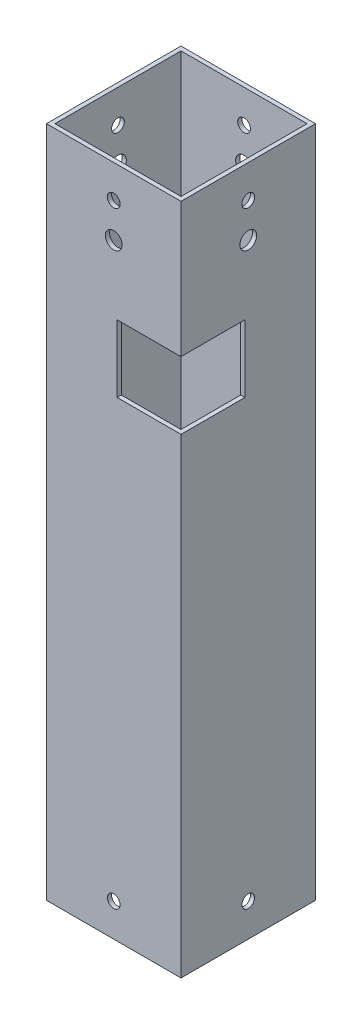
ISO-10303-21;
HEADER;
FILE_DESCRIPTION(('STEP AP214'),'2;1');
FILE_NAME('part.step','',(''),(''),'','','');
FILE_SCHEMA(('AUTOMOTIVE_DESIGN { 1 0 10303 214 1 1 1 1 }'));
ENDSEC;
DATA;
#1=APPLICATION_CONTEXT('core data for automotive mechanical design processes');
#2=APPLICATION_PROTOCOL_DEFINITION('international standard','automotive_design',2000,#1);
#3=PRODUCT_CONTEXT('',#1,'mechanical');
#4=PRODUCT('Part','Part','',(#3));
#5=PRODUCT_RELATED_PRODUCT_CATEGORY('part','',(#4));
#6=PRODUCT_DEFINITION_FORMATION('','',#4);
#7=PRODUCT_DEFINITION_CONTEXT('part definition',#1,'design');
#8=PRODUCT_DEFINITION('design','',#6,#7);
#9=PRODUCT_DEFINITION_SHAPE('','',#8);
#10=(LENGTH_UNIT() NAMED_UNIT(*) SI_UNIT(.MILLI.,.METRE.));
#11=(NAMED_UNIT(*) PLANE_ANGLE_UNIT() SI_UNIT($,.RADIAN.));
#12=(NAMED_UNIT(*) SI_UNIT($,.STERADIAN.) SOLID_ANGLE_UNIT());
#13=UNCERTAINTY_MEASURE_WITH_UNIT(LENGTH_MEASURE(1.E-05),#10,'distance_accuracy_value','');
#14=(GEOMETRIC_REPRESENTATION_CONTEXT(3) GLOBAL_UNCERTAINTY_ASSIGNED_CONTEXT((#13)) GLOBAL_UNIT_ASSIGNED_CONTEXT((#10,
#11,#12)) REPRESENTATION_CONTEXT('',''));
#15=CARTESIAN_POINT('',(0.,0.,0.));
#16=DIRECTION('',(0.,0.,1.));
#17=DIRECTION('',(1.,0.,0.));
#18=AXIS2_PLACEMENT_3D('',#15,#16,#17);
#19=CARTESIAN_POINT('',(0.,254.,0.));
#20=DIRECTION('',(0.,1.,0.));
#21=DIRECTION('',(0.,0.,1.));
#22=AXIS2_PLACEMENT_3D('',#19,#20,#21);
#23=PLANE('',#22);
#24=DIRECTION('',(0.,0.,1.));
#25=VECTOR('',#24,1.);
#26=CARTESIAN_POINT('',(-25.4,254.,-25.4));
#27=LINE('',#26,#25);
#28=CARTESIAN_POINT('',(-25.4,254.,-25.4));
#29=VERTEX_POINT('',#28);
#30=CARTESIAN_POINT('',(-25.4,254.,25.4));
#31=VERTEX_POINT('',#30);
#32=EDGE_CURVE('E304',#29,#31,#27,.T.);
#33=ORIENTED_EDGE('',*,*,#32,.T.);
#34=DIRECTION('',(1.,0.,0.));
#35=VECTOR('',#34,1.);
#36=CARTESIAN_POINT('',(-25.4,254.,25.4));
#37=LINE('',#36,#35);
#38=CARTESIAN_POINT('',(25.4,254.,25.4));
#39=VERTEX_POINT('',#38);
#40=EDGE_CURVE('E308',#31,#39,#37,.T.);
#41=ORIENTED_EDGE('',*,*,#40,.T.);
#42=DIRECTION('',(0.,0.,-1.));
#43=VECTOR('',#42,1.);
#44=CARTESIAN_POINT('',(25.4,254.,-25.4));
#45=LINE('',#44,#43);
#46=CARTESIAN_POINT('',(25.4,254.,-25.4));
#47=VERTEX_POINT('',#46);
#48=EDGE_CURVE('E312',#39,#47,#45,.T.);
#49=ORIENTED_EDGE('',*,*,#48,.T.);
#50=DIRECTION('',(-1.,0.,0.));
#51=VECTOR('',#50,1.);
#52=CARTESIAN_POINT('',(-25.4,254.,-25.4));
#53=LINE('',#52,#51);
#54=EDGE_CURVE('E315',#47,#29,#53,.T.);
#55=ORIENTED_EDGE('',*,*,#54,.T.);
#56=EDGE_LOOP('',(#33,#41,#49,#55));
#57=FACE_BOUND('',#56,.T.);
#58=DIRECTION('',(1.,0.,0.));
#59=VECTOR('',#58,1.);
#60=CARTESIAN_POINT('',(-23.8125,254.,23.8125));
#61=LINE('',#60,#59);
#62=CARTESIAN_POINT('',(-23.8125,254.,23.8125));
#63=VERTEX_POINT('',#62);
#64=CARTESIAN_POINT('',(23.8125,254.,23.8125));
#65=VERTEX_POINT('',#64);
#66=EDGE_CURVE('E262',#63,#65,#61,.T.);
#67=ORIENTED_EDGE('',*,*,#66,.F.);
#68=DIRECTION('',(0.,0.,1.));
#69=VECTOR('',#68,1.);
#70=CARTESIAN_POINT('',(-23.8125,254.,-23.8125));
#71=LINE('',#70,#69);
#72=CARTESIAN_POINT('',(-23.8125,254.,-23.8125));
#73=VERTEX_POINT('',#72);
#74=EDGE_CURVE('E259',#73,#63,#71,.T.);
#75=ORIENTED_EDGE('',*,*,#74,.F.);
#76=DIRECTION('',(-1.,0.,0.));
#77=VECTOR('',#76,1.);
#78=CARTESIAN_POINT('',(-23.8125,254.,-23.8125));
#79=LINE('',#78,#77);
#80=CARTESIAN_POINT('',(23.8125,254.,-23.8125));
#81=VERTEX_POINT('',#80);
#82=EDGE_CURVE('E270',#81,#73,#79,.T.);
#83=ORIENTED_EDGE('',*,*,#82,.F.);
#84=DIRECTION('',(0.,0.,-1.));
#85=VECTOR('',#84,1.);
#86=CARTESIAN_POINT('',(23.8125,254.,-23.8125));
#87=LINE('',#86,#85);
#88=EDGE_CURVE('E266',#65,#81,#87,.T.);
#89=ORIENTED_EDGE('',*,*,#88,.F.);
#90=EDGE_LOOP('',(#67,#75,#83,#89));
#91=FACE_BOUND('',#90,.T.);
#92=ADVANCED_FACE('F43',(#57,#91),#23,.T.);
#93=CARTESIAN_POINT('',(0.,0.,0.));
#94=DIRECTION('',(0.,1.,0.));
#95=DIRECTION('',(0.,0.,1.));
#96=AXIS2_PLACEMENT_3D('',#93,#94,#95);
#97=PLANE('',#96);
#98=DIRECTION('',(0.,0.,1.));
#99=VECTOR('',#98,1.);
#100=CARTESIAN_POINT('',(-25.4,0.,-25.4));
#101=LINE('',#100,#99);
#102=CARTESIAN_POINT('',(-25.4,0.,-25.4));
#103=VERTEX_POINT('',#102);
#104=CARTESIAN_POINT('',(-25.4,0.,25.4));
#105=VERTEX_POINT('',#104);
#106=EDGE_CURVE('E303',#103,#105,#101,.T.);
#107=ORIENTED_EDGE('',*,*,#106,.F.);
#108=DIRECTION('',(-1.,0.,0.));
#109=VECTOR('',#108,1.);
#110=CARTESIAN_POINT('',(-25.4,0.,-25.4));
#111=LINE('',#110,#109);
#112=CARTESIAN_POINT('',(25.4,0.,-25.4));
#113=VERTEX_POINT('',#112);
#114=EDGE_CURVE('E309',#113,#103,#111,.T.);
#115=ORIENTED_EDGE('',*,*,#114,.F.);
#116=DIRECTION('',(0.,0.,-1.));
#117=VECTOR('',#116,1.);
#118=CARTESIAN_POINT('',(25.4,0.,-25.4));
#119=LINE('',#118,#117);
#120=CARTESIAN_POINT('',(25.4,0.,25.4));
#121=VERTEX_POINT('',#120);
#122=EDGE_CURVE('E325',#121,#113,#119,.T.);
#123=ORIENTED_EDGE('',*,*,#122,.F.);
#124=DIRECTION('',(1.,0.,0.));
#125=VECTOR('',#124,1.);
#126=CARTESIAN_POINT('',(-25.4,0.,25.4));
#127=LINE('',#126,#125);
#128=EDGE_CURVE('E322',#105,#121,#127,.T.);
#129=ORIENTED_EDGE('',*,*,#128,.F.);
#130=EDGE_LOOP('',(#107,#115,#123,#129));
#131=FACE_BOUND('',#130,.T.);
#132=DIRECTION('',(0.,0.,1.));
#133=VECTOR('',#132,1.);
#134=CARTESIAN_POINT('',(-23.8125,0.,-23.8125));
#135=LINE('',#134,#133);
#136=CARTESIAN_POINT('',(-23.8125,0.,-23.8125));
#137=VERTEX_POINT('',#136);
#138=CARTESIAN_POINT('',(-23.8125,0.,23.8125));
#139=VERTEX_POINT('',#138);
#140=EDGE_CURVE('E258',#137,#139,#135,.T.);
#141=ORIENTED_EDGE('',*,*,#140,.T.);
#142=DIRECTION('',(1.,0.,0.));
#143=VECTOR('',#142,1.);
#144=CARTESIAN_POINT('',(-23.8125,0.,23.8125));
#145=LINE('',#144,#143);
#146=CARTESIAN_POINT('',(23.8125,0.,23.8125));
#147=VERTEX_POINT('',#146);
#148=EDGE_CURVE('E277',#139,#147,#145,.T.);
#149=ORIENTED_EDGE('',*,*,#148,.T.);
#150=DIRECTION('',(0.,0.,-1.));
#151=VECTOR('',#150,1.);
#152=CARTESIAN_POINT('',(23.8125,0.,-23.8125));
#153=LINE('',#152,#151);
#154=CARTESIAN_POINT('',(23.8125,0.,-23.8125));
#155=VERTEX_POINT('',#154);
#156=EDGE_CURVE('E281',#147,#155,#153,.T.);
#157=ORIENTED_EDGE('',*,*,#156,.T.);
#158=DIRECTION('',(-1.,0.,0.));
#159=VECTOR('',#158,1.);
#160=CARTESIAN_POINT('',(-23.8125,0.,-23.8125));
#161=LINE('',#160,#159);
#162=EDGE_CURVE('E263',#155,#137,#161,.T.);
#163=ORIENTED_EDGE('',*,*,#162,.T.);
#164=EDGE_LOOP('',(#141,#149,#157,#163));
#165=FACE_BOUND('',#164,.T.);
#166=ADVANCED_FACE('F416',(#131,#165),#97,.F.);
#167=CARTESIAN_POINT('',(-25.4,254.,-25.4));
#168=DIRECTION('',(1.,0.,0.));
#169=DIRECTION('',(0.,0.,-1.));
#170=AXIS2_PLACEMENT_3D('',#167,#168,#169);
#171=PLANE('',#170);
#172=CARTESIAN_POINT('',(-25.4,228.6,0.));
#173=DIRECTION('',(1.,0.,0.));
#174=DIRECTION('',(0.,0.,-1.));
#175=AXIS2_PLACEMENT_3D('',#172,#173,#174);
#176=CIRCLE('',#175,3.175);
#177=CARTESIAN_POINT('',(-25.4,228.6,-3.175));
#178=VERTEX_POINT('',#177);
#179=EDGE_CURVE('E181',#178,#178,#176,.T.);
#180=ORIENTED_EDGE('',*,*,#179,.T.);
#181=EDGE_LOOP('',(#180));
#182=FACE_BOUND('',#181,.T.);
#183=CARTESIAN_POINT('',(-25.4,12.412400118,0.));
#184=DIRECTION('',(1.,0.,0.));
#185=DIRECTION('',(0.,0.,-1.));
#186=AXIS2_PLACEMENT_3D('',#183,#184,#185);
#187=CIRCLE('',#186,2.3999952);
#188=CARTESIAN_POINT('',(-25.4,12.412400118,-2.3999952));
#189=VERTEX_POINT('',#188);
#190=EDGE_CURVE('E219',#189,#189,#187,.T.);
#191=ORIENTED_EDGE('',*,*,#190,.T.);
#192=EDGE_LOOP('',(#191));
#193=FACE_BOUND('',#192,.T.);
#194=CARTESIAN_POINT('',(-25.4,241.587599882,0.));
#195=DIRECTION('',(1.,0.,0.));
#196=DIRECTION('',(0.,0.,-1.));
#197=AXIS2_PLACEMENT_3D('',#194,#195,#196);
#198=CIRCLE('',#197,2.39999520000001);
#199=CARTESIAN_POINT('',(-25.4,241.587599882,-2.39999520000001));
#200=VERTEX_POINT('',#199);
#201=EDGE_CURVE('E245',#200,#200,#198,.T.);
#202=ORIENTED_EDGE('',*,*,#201,.T.);
#203=EDGE_LOOP('',(#202));
#204=FACE_BOUND('',#203,.T.);
#205=ORIENTED_EDGE('',*,*,#106,.T.);
#206=DIRECTION('',(0.,-1.,0.));
#207=VECTOR('',#206,1.);
#208=CARTESIAN_POINT('',(-25.4,254.,25.4));
#209=LINE('',#208,#207);
#210=EDGE_CURVE('E341',#31,#105,#209,.T.);
#211=ORIENTED_EDGE('',*,*,#210,.F.);
#212=ORIENTED_EDGE('',*,*,#32,.F.);
#213=DIRECTION('',(0.,-1.,0.));
#214=VECTOR('',#213,1.);
#215=CARTESIAN_POINT('',(-25.4,254.,-25.4));
#216=LINE('',#215,#214);
#217=EDGE_CURVE('E318',#29,#103,#216,.T.);
#218=ORIENTED_EDGE('',*,*,#217,.T.);
#219=EDGE_LOOP('',(#205,#211,#212,#218));
#220=FACE_BOUND('',#219,.T.);
#221=ADVANCED_FACE('F45',(#182,#193,#204,#220),#171,.F.);
#222=CARTESIAN_POINT('',(-25.4,254.,25.4));
#223=DIRECTION('',(0.,0.,-1.));
#224=DIRECTION('',(-1.,0.,0.));
#225=AXIS2_PLACEMENT_3D('',#222,#223,#224);
#226=PLANE('',#225);
#227=CARTESIAN_POINT('',(0.,228.6,25.4));
#228=DIRECTION('',(0.,0.,-1.));
#229=DIRECTION('',(-1.,0.,0.));
#230=AXIS2_PLACEMENT_3D('',#227,#228,#229);
#231=CIRCLE('',#230,3.175);
#232=CARTESIAN_POINT('',(-3.17499999999999,228.6,25.4));
#233=VERTEX_POINT('',#232);
#234=EDGE_CURVE('E193',#233,#233,#231,.T.);
#235=ORIENTED_EDGE('',*,*,#234,.T.);
#236=EDGE_LOOP('',(#235));
#237=FACE_BOUND('',#236,.T.);
#238=CARTESIAN_POINT('',(0.,12.412400118,25.4));
#239=DIRECTION('',(0.,0.,-1.));
#240=DIRECTION('',(-1.,0.,0.));
#241=AXIS2_PLACEMENT_3D('',#238,#239,#240);
#242=CIRCLE('',#241,2.3999952);
#243=CARTESIAN_POINT('',(-2.3999952,12.412400118,25.4));
#244=VERTEX_POINT('',#243);
#245=EDGE_CURVE('E207',#244,#244,#242,.T.);
#246=ORIENTED_EDGE('',*,*,#245,.T.);
#247=EDGE_LOOP('',(#246));
#248=FACE_BOUND('',#247,.T.);
#249=CARTESIAN_POINT('',(0.,241.587599882,25.4));
#250=DIRECTION('',(0.,0.,-1.));
#251=DIRECTION('',(-1.,0.,0.));
#252=AXIS2_PLACEMENT_3D('',#249,#250,#251);
#253=CIRCLE('',#252,2.39999520000001);
#254=CARTESIAN_POINT('',(-2.39999520000001,241.587599882,25.4));
#255=VERTEX_POINT('',#254);
#256=EDGE_CURVE('E233',#255,#255,#253,.T.);
#257=ORIENTED_EDGE('',*,*,#256,.T.);
#258=EDGE_LOOP('',(#257));
#259=FACE_BOUND('',#258,.T.);
#260=DIRECTION('',(0.,-1.,0.));
#261=VECTOR('',#260,1.);
#262=CARTESIAN_POINT('',(1.27000000000001,203.2,25.4));
#263=LINE('',#262,#261);
#264=CARTESIAN_POINT('',(1.27000000000001,203.2,25.4));
#265=VERTEX_POINT('',#264);
#266=CARTESIAN_POINT('',(1.27000000000001,177.8,25.4));
#267=VERTEX_POINT('',#266);
#268=EDGE_CURVE('E150',#265,#267,#263,.T.);
#269=ORIENTED_EDGE('',*,*,#268,.F.);
#270=DIRECTION('',(1.,0.,0.));
#271=VECTOR('',#270,1.);
#272=CARTESIAN_POINT('',(1.27000000000001,203.2,25.4));
#273=LINE('',#272,#271);
#274=CARTESIAN_POINT('',(25.4,203.2,25.4));
#275=VERTEX_POINT('',#274);
#276=EDGE_CURVE('E177',#265,#275,#273,.T.);
#277=ORIENTED_EDGE('',*,*,#276,.T.);
#278=DIRECTION('',(0.,-1.,0.));
#279=VECTOR('',#278,1.);
#280=CARTESIAN_POINT('',(25.4,254.,25.4));
#281=LINE('',#280,#279);
#282=EDGE_CURVE('E337',#39,#275,#281,.T.);
#283=ORIENTED_EDGE('',*,*,#282,.F.);
#284=ORIENTED_EDGE('',*,*,#40,.F.);
#285=ORIENTED_EDGE('',*,*,#210,.T.);
#286=ORIENTED_EDGE('',*,*,#128,.T.);
#287=CARTESIAN_POINT('',(25.4,177.8,25.4));
#288=VERTEX_POINT('',#287);
#289=EDGE_CURVE('E164',#288,#121,#281,.T.);
#290=ORIENTED_EDGE('',*,*,#289,.F.);
#291=DIRECTION('',(1.,0.,0.));
#292=VECTOR('',#291,1.);
#293=CARTESIAN_POINT('',(1.27000000000001,177.8,25.4));
#294=LINE('',#293,#292);
#295=EDGE_CURVE('E59',#267,#288,#294,.T.);
#296=ORIENTED_EDGE('',*,*,#295,.F.);
#297=EDGE_LOOP('',(#269,#277,#283,#284,#285,#286,#290,#296));
#298=FACE_BOUND('',#297,.T.);
#299=ADVANCED_FACE('F162',(#237,#248,#259,#298),#226,.F.);
#300=CARTESIAN_POINT('',(25.4,254.,-25.4));
#301=DIRECTION('',(-1.,0.,0.));
#302=DIRECTION('',(0.,0.,1.));
#303=AXIS2_PLACEMENT_3D('',#300,#301,#302);
#304=PLANE('',#303);
#305=CARTESIAN_POINT('',(25.4,228.6,0.));
#306=DIRECTION('',(1.,0.,0.));
#307=DIRECTION('',(0.,0.,-1.));
#308=AXIS2_PLACEMENT_3D('',#305,#306,#307);
#309=CIRCLE('',#308,3.175);
#310=CARTESIAN_POINT('',(25.4,228.6,-3.175));
#311=VERTEX_POINT('',#310);
#312=EDGE_CURVE('E180',#311,#311,#309,.T.);
#313=ORIENTED_EDGE('',*,*,#312,.F.);
#314=EDGE_LOOP('',(#313));
#315=FACE_BOUND('',#314,.T.);
#316=CARTESIAN_POINT('',(25.4,12.412400118,0.));
#317=DIRECTION('',(-1.,0.,0.));
#318=DIRECTION('',(0.,0.,1.));
#319=AXIS2_PLACEMENT_3D('',#316,#317,#318);
#320=CIRCLE('',#319,2.3999952);
#321=CARTESIAN_POINT('',(25.4,12.412400118,2.3999952));
#322=VERTEX_POINT('',#321);
#323=EDGE_CURVE('E228',#322,#322,#320,.T.);
#324=ORIENTED_EDGE('',*,*,#323,.T.);
#325=EDGE_LOOP('',(#324));
#326=FACE_BOUND('',#325,.T.);
#327=CARTESIAN_POINT('',(25.4,241.587599882,0.));
#328=DIRECTION('',(1.,0.,0.));
#329=DIRECTION('',(0.,0.,-1.));
#330=AXIS2_PLACEMENT_3D('',#327,#328,#329);
#331=CIRCLE('',#330,2.39999520000001);
#332=CARTESIAN_POINT('',(25.4,241.587599882,-2.39999520000001));
#333=VERTEX_POINT('',#332);
#334=EDGE_CURVE('E249',#333,#333,#331,.T.);
#335=ORIENTED_EDGE('',*,*,#334,.F.);
#336=EDGE_LOOP('',(#335));
#337=FACE_BOUND('',#336,.T.);
#338=ORIENTED_EDGE('',*,*,#282,.T.);
#339=DIRECTION('',(0.,0.,1.));
#340=VECTOR('',#339,1.);
#341=CARTESIAN_POINT('',(25.4,203.2,25.4));
#342=LINE('',#341,#340);
#343=CARTESIAN_POINT('',(25.4,203.2,1.27));
#344=VERTEX_POINT('',#343);
#345=EDGE_CURVE('E159',#344,#275,#342,.T.);
#346=ORIENTED_EDGE('',*,*,#345,.F.);
#347=DIRECTION('',(0.,1.,0.));
#348=VECTOR('',#347,1.);
#349=CARTESIAN_POINT('',(25.4,203.2,1.27));
#350=LINE('',#349,#348);
#351=CARTESIAN_POINT('',(25.4,177.8,1.26999999999999));
#352=VERTEX_POINT('',#351);
#353=EDGE_CURVE('E382',#352,#344,#350,.T.);
#354=ORIENTED_EDGE('',*,*,#353,.F.);
#355=DIRECTION('',(0.,0.,-1.));
#356=VECTOR('',#355,1.);
#357=CARTESIAN_POINT('',(25.4,177.8,25.4));
#358=LINE('',#357,#356);
#359=EDGE_CURVE('E400',#288,#352,#358,.T.);
#360=ORIENTED_EDGE('',*,*,#359,.F.);
#361=ORIENTED_EDGE('',*,*,#289,.T.);
#362=ORIENTED_EDGE('',*,*,#122,.T.);
#363=DIRECTION('',(0.,-1.,0.));
#364=VECTOR('',#363,1.);
#365=CARTESIAN_POINT('',(25.4,254.,-25.4));
#366=LINE('',#365,#364);
#367=EDGE_CURVE('E333',#47,#113,#366,.T.);
#368=ORIENTED_EDGE('',*,*,#367,.F.);
#369=ORIENTED_EDGE('',*,*,#48,.F.);
#370=EDGE_LOOP('',(#338,#346,#354,#360,#361,#362,#368,#369));
#371=FACE_BOUND('',#370,.T.);
#372=ADVANCED_FACE('F403',(#315,#326,#337,#371),#304,.F.);
#373=CARTESIAN_POINT('',(-25.4,254.,-25.4));
#374=DIRECTION('',(0.,0.,1.));
#375=DIRECTION('',(1.,0.,0.));
#376=AXIS2_PLACEMENT_3D('',#373,#374,#375);
#377=PLANE('',#376);
#378=CARTESIAN_POINT('',(0.,228.6,-25.4));
#379=DIRECTION('',(0.,0.,1.));
#380=DIRECTION('',(1.,0.,0.));
#381=AXIS2_PLACEMENT_3D('',#378,#379,#380);
#382=CIRCLE('',#381,3.175);
#383=CARTESIAN_POINT('',(3.175,228.6,-25.4));
#384=VERTEX_POINT('',#383);
#385=EDGE_CURVE('E202',#384,#384,#382,.T.);
#386=ORIENTED_EDGE('',*,*,#385,.T.);
#387=EDGE_LOOP('',(#386));
#388=FACE_BOUND('',#387,.T.);
#389=CARTESIAN_POINT('',(0.,12.412400118,-25.4));
#390=DIRECTION('',(0.,0.,-1.));
#391=DIRECTION('',(-1.,0.,0.));
#392=AXIS2_PLACEMENT_3D('',#389,#390,#391);
#393=CIRCLE('',#392,2.3999952);
#394=CARTESIAN_POINT('',(-2.39999520000001,12.412400118,-25.4));
#395=VERTEX_POINT('',#394);
#396=EDGE_CURVE('E206',#395,#395,#393,.T.);
#397=ORIENTED_EDGE('',*,*,#396,.F.);
#398=EDGE_LOOP('',(#397));
#399=FACE_BOUND('',#398,.T.);
#400=CARTESIAN_POINT('',(0.,241.587599882,-25.4));
#401=DIRECTION('',(0.,0.,-1.));
#402=DIRECTION('',(-1.,0.,0.));
#403=AXIS2_PLACEMENT_3D('',#400,#401,#402);
#404=CIRCLE('',#403,2.39999520000001);
#405=CARTESIAN_POINT('',(-2.39999520000001,241.587599882,-25.4));
#406=VERTEX_POINT('',#405);
#407=EDGE_CURVE('E232',#406,#406,#404,.T.);
#408=ORIENTED_EDGE('',*,*,#407,.F.);
#409=EDGE_LOOP('',(#408));
#410=FACE_BOUND('',#409,.T.);
#411=ORIENTED_EDGE('',*,*,#114,.T.);
#412=ORIENTED_EDGE('',*,*,#217,.F.);
#413=ORIENTED_EDGE('',*,*,#54,.F.);
#414=ORIENTED_EDGE('',*,*,#367,.T.);
#415=EDGE_LOOP('',(#411,#412,#413,#414));
#416=FACE_BOUND('',#415,.T.);
#417=ADVANCED_FACE('F420',(#388,#399,#410,#416),#377,.F.);
#418=CARTESIAN_POINT('',(-23.8125,254.,-23.8125));
#419=DIRECTION('',(1.,0.,0.));
#420=DIRECTION('',(0.,0.,-1.));
#421=AXIS2_PLACEMENT_3D('',#418,#419,#420);
#422=PLANE('',#421);
#423=CARTESIAN_POINT('',(-23.8125,228.6,0.));
#424=DIRECTION('',(1.,0.,0.));
#425=DIRECTION('',(0.,0.,-1.));
#426=AXIS2_PLACEMENT_3D('',#423,#424,#425);
#427=CIRCLE('',#426,3.175);
#428=CARTESIAN_POINT('',(-23.8125,228.6,-3.175));
#429=VERTEX_POINT('',#428);
#430=EDGE_CURVE('E189',#429,#429,#427,.T.);
#431=ORIENTED_EDGE('',*,*,#430,.F.);
#432=EDGE_LOOP('',(#431));
#433=FACE_BOUND('',#432,.T.);
#434=CARTESIAN_POINT('',(-23.8125,12.412400118,0.));
#435=DIRECTION('',(1.,0.,0.));
#436=DIRECTION('',(0.,0.,-1.));
#437=AXIS2_PLACEMENT_3D('',#434,#435,#436);
#438=CIRCLE('',#437,2.3999952);
#439=CARTESIAN_POINT('',(-23.8125,12.412400118,-2.3999952));
#440=VERTEX_POINT('',#439);
#441=EDGE_CURVE('E224',#440,#440,#438,.T.);
#442=ORIENTED_EDGE('',*,*,#441,.F.);
#443=EDGE_LOOP('',(#442));
#444=FACE_BOUND('',#443,.T.);
#445=CARTESIAN_POINT('',(-23.8125,241.587599882,0.));
#446=DIRECTION('',(1.,0.,0.));
#447=DIRECTION('',(0.,0.,-1.));
#448=AXIS2_PLACEMENT_3D('',#445,#446,#447);
#449=CIRCLE('',#448,2.39999520000001);
#450=CARTESIAN_POINT('',(-23.8125,241.587599882,-2.39999520000001));
#451=VERTEX_POINT('',#450);
#452=EDGE_CURVE('E254',#451,#451,#449,.F.);
#453=ORIENTED_EDGE('',*,*,#452,.T.);
#454=EDGE_LOOP('',(#453));
#455=FACE_BOUND('',#454,.T.);
#456=ORIENTED_EDGE('',*,*,#140,.F.);
#457=DIRECTION('',(0.,-1.,0.));
#458=VECTOR('',#457,1.);
#459=CARTESIAN_POINT('',(-23.8125,254.,-23.8125));
#460=LINE('',#459,#458);
#461=EDGE_CURVE('E273',#73,#137,#460,.T.);
#462=ORIENTED_EDGE('',*,*,#461,.F.);
#463=ORIENTED_EDGE('',*,*,#74,.T.);
#464=DIRECTION('',(0.,-1.,0.));
#465=VECTOR('',#464,1.);
#466=CARTESIAN_POINT('',(-23.8125,254.,23.8125));
#467=LINE('',#466,#465);
#468=EDGE_CURVE('E299',#63,#139,#467,.T.);
#469=ORIENTED_EDGE('',*,*,#468,.T.);
#470=EDGE_LOOP('',(#456,#462,#463,#469));
#471=FACE_BOUND('',#470,.T.);
#472=ADVANCED_FACE('F422',(#433,#444,#455,#471),#422,.T.);
#473=CARTESIAN_POINT('',(-23.8125,254.,23.8125));
#474=DIRECTION('',(0.,0.,-1.));
#475=DIRECTION('',(-1.,0.,0.));
#476=AXIS2_PLACEMENT_3D('',#473,#474,#475);
#477=PLANE('',#476);
#478=DIRECTION('',(1.,0.,0.));
#479=VECTOR('',#478,1.);
#480=CARTESIAN_POINT('',(-23.8125,203.2,23.8125));
#481=LINE('',#480,#479);
#482=CARTESIAN_POINT('',(1.27000000000001,203.2,23.8125));
#483=VERTEX_POINT('',#482);
#484=CARTESIAN_POINT('',(23.8125,203.2,23.8125));
#485=VERTEX_POINT('',#484);
#486=EDGE_CURVE('E176',#483,#485,#481,.T.);
#487=ORIENTED_EDGE('',*,*,#486,.F.);
#488=DIRECTION('',(0.,-1.,0.));
#489=VECTOR('',#488,1.);
#490=CARTESIAN_POINT('',(1.27000000000001,254.,23.8125));
#491=LINE('',#490,#489);
#492=CARTESIAN_POINT('',(1.27000000000001,177.8,23.8125));
#493=VERTEX_POINT('',#492);
#494=EDGE_CURVE('E11',#483,#493,#491,.T.);
#495=ORIENTED_EDGE('',*,*,#494,.T.);
#496=DIRECTION('',(-1.,0.,0.));
#497=VECTOR('',#496,1.);
#498=CARTESIAN_POINT('',(-23.8125,177.8,23.8125));
#499=LINE('',#498,#497);
#500=CARTESIAN_POINT('',(23.8125,177.8,23.8125));
#501=VERTEX_POINT('',#500);
#502=EDGE_CURVE('E146',#501,#493,#499,.T.);
#503=ORIENTED_EDGE('',*,*,#502,.F.);
#504=DIRECTION('',(0.,-1.,0.));
#505=VECTOR('',#504,1.);
#506=CARTESIAN_POINT('',(23.8125,254.,23.8125));
#507=LINE('',#506,#505);
#508=EDGE_CURVE('E294',#501,#147,#507,.T.);
#509=ORIENTED_EDGE('',*,*,#508,.T.);
#510=ORIENTED_EDGE('',*,*,#148,.F.);
#511=ORIENTED_EDGE('',*,*,#468,.F.);
#512=ORIENTED_EDGE('',*,*,#66,.T.);
#513=EDGE_CURVE('E295',#65,#485,#507,.T.);
#514=ORIENTED_EDGE('',*,*,#513,.T.);
#515=EDGE_LOOP('',(#487,#495,#503,#509,#510,#511,#512,#514));
#516=FACE_BOUND('',#515,.T.);
#517=CARTESIAN_POINT('',(0.,228.6,23.8125));
#518=DIRECTION('',(0.,0.,-1.));
#519=DIRECTION('',(-1.,0.,0.));
#520=AXIS2_PLACEMENT_3D('',#517,#518,#519);
#521=CIRCLE('',#520,3.175);
#522=CARTESIAN_POINT('',(-3.17499999999999,228.6,23.8125));
#523=VERTEX_POINT('',#522);
#524=EDGE_CURVE('E198',#523,#523,#521,.T.);
#525=ORIENTED_EDGE('',*,*,#524,.F.);
#526=EDGE_LOOP('',(#525));
#527=FACE_BOUND('',#526,.T.);
#528=CARTESIAN_POINT('',(0.,12.412400118,23.8125));
#529=DIRECTION('',(0.,0.,-1.));
#530=DIRECTION('',(-1.,0.,0.));
#531=AXIS2_PLACEMENT_3D('',#528,#529,#530);
#532=CIRCLE('',#531,2.3999952);
#533=CARTESIAN_POINT('',(-2.39999520000001,12.412400118,23.8125));
#534=VERTEX_POINT('',#533);
#535=EDGE_CURVE('E215',#534,#534,#532,.T.);
#536=ORIENTED_EDGE('',*,*,#535,.F.);
#537=EDGE_LOOP('',(#536));
#538=FACE_BOUND('',#537,.T.);
#539=CARTESIAN_POINT('',(0.,241.587599882,23.8125));
#540=DIRECTION('',(0.,0.,-1.));
#541=DIRECTION('',(-1.,0.,0.));
#542=AXIS2_PLACEMENT_3D('',#539,#540,#541);
#543=CIRCLE('',#542,2.39999520000001);
#544=CARTESIAN_POINT('',(-2.39999520000001,241.587599882,23.8125));
#545=VERTEX_POINT('',#544);
#546=EDGE_CURVE('E241',#545,#545,#543,.T.);
#547=ORIENTED_EDGE('',*,*,#546,.F.);
#548=EDGE_LOOP('',(#547));
#549=FACE_BOUND('',#548,.T.);
#550=ADVANCED_FACE('F390',(#516,#527,#538,#549),#477,.T.);
#551=CARTESIAN_POINT('',(23.8125,254.,-23.8125));
#552=DIRECTION('',(-1.,0.,0.));
#553=DIRECTION('',(0.,0.,1.));
#554=AXIS2_PLACEMENT_3D('',#551,#552,#553);
#555=PLANE('',#554);
#556=DIRECTION('',(0.,0.,-1.));
#557=VECTOR('',#556,1.);
#558=CARTESIAN_POINT('',(23.8125,203.2,-23.8125));
#559=LINE('',#558,#557);
#560=CARTESIAN_POINT('',(23.8125,203.2,1.27));
#561=VERTEX_POINT('',#560);
#562=EDGE_CURVE('E52',#485,#561,#559,.T.);
#563=ORIENTED_EDGE('',*,*,#562,.F.);
#564=ORIENTED_EDGE('',*,*,#513,.F.);
#565=ORIENTED_EDGE('',*,*,#88,.T.);
#566=DIRECTION('',(0.,-1.,0.));
#567=VECTOR('',#566,1.);
#568=CARTESIAN_POINT('',(23.8125,254.,-23.8125));
#569=LINE('',#568,#567);
#570=EDGE_CURVE('E291',#81,#155,#569,.T.);
#571=ORIENTED_EDGE('',*,*,#570,.T.);
#572=ORIENTED_EDGE('',*,*,#156,.F.);
#573=ORIENTED_EDGE('',*,*,#508,.F.);
#574=DIRECTION('',(0.,0.,1.));
#575=VECTOR('',#574,1.);
#576=CARTESIAN_POINT('',(23.8125,177.8,-23.8125));
#577=LINE('',#576,#575);
#578=CARTESIAN_POINT('',(23.8125,177.8,1.26999999999999));
#579=VERTEX_POINT('',#578);
#580=EDGE_CURVE('E345',#579,#501,#577,.T.);
#581=ORIENTED_EDGE('',*,*,#580,.F.);
#582=DIRECTION('',(0.,-1.,0.));
#583=VECTOR('',#582,1.);
#584=CARTESIAN_POINT('',(23.8125,254.,1.27));
#585=LINE('',#584,#583);
#586=EDGE_CURVE('E366',#561,#579,#585,.T.);
#587=ORIENTED_EDGE('',*,*,#586,.F.);
#588=EDGE_LOOP('',(#563,#564,#565,#571,#572,#573,#581,#587));
#589=FACE_BOUND('',#588,.T.);
#590=CARTESIAN_POINT('',(23.8125,228.6,0.));
#591=DIRECTION('',(-1.,0.,0.));
#592=DIRECTION('',(0.,0.,1.));
#593=AXIS2_PLACEMENT_3D('',#590,#591,#592);
#594=CIRCLE('',#593,3.175);
#595=CARTESIAN_POINT('',(23.8125,228.6,3.17499999999999));
#596=VERTEX_POINT('',#595);
#597=EDGE_CURVE('E185',#596,#596,#594,.T.);
#598=ORIENTED_EDGE('',*,*,#597,.F.);
#599=EDGE_LOOP('',(#598));
#600=FACE_BOUND('',#599,.T.);
#601=CARTESIAN_POINT('',(23.8125,12.412400118,0.));
#602=DIRECTION('',(-1.,0.,0.));
#603=DIRECTION('',(0.,0.,1.));
#604=AXIS2_PLACEMENT_3D('',#601,#602,#603);
#605=CIRCLE('',#604,2.3999952);
#606=CARTESIAN_POINT('',(23.8125,12.412400118,2.3999952));
#607=VERTEX_POINT('',#606);
#608=EDGE_CURVE('E223',#607,#607,#605,.T.);
#609=ORIENTED_EDGE('',*,*,#608,.F.);
#610=EDGE_LOOP('',(#609));
#611=FACE_BOUND('',#610,.T.);
#612=CARTESIAN_POINT('',(23.8125,241.587599882,0.));
#613=DIRECTION('',(-1.,0.,0.));
#614=DIRECTION('',(0.,0.,1.));
#615=AXIS2_PLACEMENT_3D('',#612,#613,#614);
#616=CIRCLE('',#615,2.39999520000001);
#617=CARTESIAN_POINT('',(23.8125,241.587599882,2.39999520000001));
#618=VERTEX_POINT('',#617);
#619=EDGE_CURVE('E253',#618,#618,#616,.F.);
#620=ORIENTED_EDGE('',*,*,#619,.T.);
#621=EDGE_LOOP('',(#620));
#622=FACE_BOUND('',#621,.T.);
#623=ADVANCED_FACE('F385',(#589,#600,#611,#622),#555,.T.);
#624=CARTESIAN_POINT('',(-23.8125,254.,-23.8125));
#625=DIRECTION('',(0.,0.,1.));
#626=DIRECTION('',(1.,0.,0.));
#627=AXIS2_PLACEMENT_3D('',#624,#625,#626);
#628=PLANE('',#627);
#629=CARTESIAN_POINT('',(0.,228.6,-23.8125));
#630=DIRECTION('',(0.,0.,1.));
#631=DIRECTION('',(1.,0.,0.));
#632=AXIS2_PLACEMENT_3D('',#629,#630,#631);
#633=CIRCLE('',#632,3.175);
#634=CARTESIAN_POINT('',(3.175,228.6,-23.8125));
#635=VERTEX_POINT('',#634);
#636=EDGE_CURVE('E197',#635,#635,#633,.T.);
#637=ORIENTED_EDGE('',*,*,#636,.F.);
#638=EDGE_LOOP('',(#637));
#639=FACE_BOUND('',#638,.T.);
#640=CARTESIAN_POINT('',(0.,12.412400118,-23.8125));
#641=DIRECTION('',(0.,0.,1.));
#642=DIRECTION('',(1.,0.,0.));
#643=AXIS2_PLACEMENT_3D('',#640,#641,#642);
#644=CIRCLE('',#643,2.3999952);
#645=CARTESIAN_POINT('',(2.39999519999999,12.412400118,-23.8125));
#646=VERTEX_POINT('',#645);
#647=EDGE_CURVE('E211',#646,#646,#644,.T.);
#648=ORIENTED_EDGE('',*,*,#647,.F.);
#649=EDGE_LOOP('',(#648));
#650=FACE_BOUND('',#649,.T.);
#651=CARTESIAN_POINT('',(0.,241.587599882,-23.8125));
#652=DIRECTION('',(0.,0.,1.));
#653=DIRECTION('',(1.,0.,0.));
#654=AXIS2_PLACEMENT_3D('',#651,#652,#653);
#655=CIRCLE('',#654,2.39999520000001);
#656=CARTESIAN_POINT('',(2.39999520000001,241.587599882,-23.8125));
#657=VERTEX_POINT('',#656);
#658=EDGE_CURVE('E237',#657,#657,#655,.T.);
#659=ORIENTED_EDGE('',*,*,#658,.F.);
#660=EDGE_LOOP('',(#659));
#661=FACE_BOUND('',#660,.T.);
#662=ORIENTED_EDGE('',*,*,#162,.F.);
#663=ORIENTED_EDGE('',*,*,#570,.F.);
#664=ORIENTED_EDGE('',*,*,#82,.T.);
#665=ORIENTED_EDGE('',*,*,#461,.T.);
#666=EDGE_LOOP('',(#662,#663,#664,#665));
#667=FACE_BOUND('',#666,.T.);
#668=ADVANCED_FACE('F445',(#639,#650,#661,#667),#628,.T.);
#669=CARTESIAN_POINT('',(25.4,241.587599882,0.));
#670=DIRECTION('',(-1.,0.,0.));
#671=DIRECTION('',(0.,0.,1.));
#672=AXIS2_PLACEMENT_3D('',#669,#670,#671);
#673=CYLINDRICAL_SURFACE('',#672,2.39999520000001);
#674=ORIENTED_EDGE('',*,*,#619,.F.);
#675=EDGE_LOOP('',(#674));
#676=FACE_BOUND('',#675,.T.);
#677=ORIENTED_EDGE('',*,*,#334,.T.);
#678=EDGE_LOOP('',(#677));
#679=FACE_BOUND('',#678,.T.);
#680=ADVANCED_FACE('F448',(#676,#679),#673,.F.);
#681=ORIENTED_EDGE('',*,*,#452,.F.);
#682=EDGE_LOOP('',(#681));
#683=FACE_BOUND('',#682,.T.);
#684=ORIENTED_EDGE('',*,*,#201,.F.);
#685=EDGE_LOOP('',(#684));
#686=FACE_BOUND('',#685,.T.);
#687=ADVANCED_FACE('F452',(#683,#686),#673,.F.);
#688=CARTESIAN_POINT('',(0.,241.587599882,25.4));
#689=DIRECTION('',(0.,0.,-1.));
#690=DIRECTION('',(-1.,0.,0.));
#691=AXIS2_PLACEMENT_3D('',#688,#689,#690);
#692=CYLINDRICAL_SURFACE('',#691,2.39999520000001);
#693=ORIENTED_EDGE('',*,*,#658,.T.);
#694=EDGE_LOOP('',(#693));
#695=FACE_BOUND('',#694,.T.);
#696=ORIENTED_EDGE('',*,*,#407,.T.);
#697=EDGE_LOOP('',(#696));
#698=FACE_BOUND('',#697,.T.);
#699=ADVANCED_FACE('F454',(#695,#698),#692,.F.);
#700=ORIENTED_EDGE('',*,*,#546,.T.);
#701=EDGE_LOOP('',(#700));
#702=FACE_BOUND('',#701,.T.);
#703=ORIENTED_EDGE('',*,*,#256,.F.);
#704=EDGE_LOOP('',(#703));
#705=FACE_BOUND('',#704,.T.);
#706=ADVANCED_FACE('F457',(#702,#705),#692,.F.);
#707=CARTESIAN_POINT('',(-25.4,12.412400118,0.));
#708=DIRECTION('',(1.,0.,0.));
#709=DIRECTION('',(0.,0.,-1.));
#710=AXIS2_PLACEMENT_3D('',#707,#708,#709);
#711=CYLINDRICAL_SURFACE('',#710,2.3999952);
#712=ORIENTED_EDGE('',*,*,#608,.T.);
#713=EDGE_LOOP('',(#712));
#714=FACE_BOUND('',#713,.T.);
#715=ORIENTED_EDGE('',*,*,#323,.F.);
#716=EDGE_LOOP('',(#715));
#717=FACE_BOUND('',#716,.T.);
#718=ADVANCED_FACE('F459',(#714,#717),#711,.F.);
#719=ORIENTED_EDGE('',*,*,#441,.T.);
#720=EDGE_LOOP('',(#719));
#721=FACE_BOUND('',#720,.T.);
#722=ORIENTED_EDGE('',*,*,#190,.F.);
#723=EDGE_LOOP('',(#722));
#724=FACE_BOUND('',#723,.T.);
#725=ADVANCED_FACE('F462',(#721,#724),#711,.F.);
#726=CARTESIAN_POINT('',(0.,12.412400118,25.4));
#727=DIRECTION('',(0.,0.,-1.));
#728=DIRECTION('',(-1.,0.,0.));
#729=AXIS2_PLACEMENT_3D('',#726,#727,#728);
#730=CYLINDRICAL_SURFACE('',#729,2.3999952);
#731=ORIENTED_EDGE('',*,*,#647,.T.);
#732=EDGE_LOOP('',(#731));
#733=FACE_BOUND('',#732,.T.);
#734=ORIENTED_EDGE('',*,*,#396,.T.);
#735=EDGE_LOOP('',(#734));
#736=FACE_BOUND('',#735,.T.);
#737=ADVANCED_FACE('F464',(#733,#736),#730,.F.);
#738=ORIENTED_EDGE('',*,*,#535,.T.);
#739=EDGE_LOOP('',(#738));
#740=FACE_BOUND('',#739,.T.);
#741=ORIENTED_EDGE('',*,*,#245,.F.);
#742=EDGE_LOOP('',(#741));
#743=FACE_BOUND('',#742,.T.);
#744=ADVANCED_FACE('F467',(#740,#743),#730,.F.);
#745=CARTESIAN_POINT('',(0.,228.6,25.4));
#746=DIRECTION('',(0.,0.,-1.));
#747=DIRECTION('',(-1.,0.,0.));
#748=AXIS2_PLACEMENT_3D('',#745,#746,#747);
#749=CYLINDRICAL_SURFACE('',#748,3.175);
#750=ORIENTED_EDGE('',*,*,#636,.T.);
#751=EDGE_LOOP('',(#750));
#752=FACE_BOUND('',#751,.T.);
#753=ORIENTED_EDGE('',*,*,#385,.F.);
#754=EDGE_LOOP('',(#753));
#755=FACE_BOUND('',#754,.T.);
#756=ADVANCED_FACE('F469',(#752,#755),#749,.F.);
#757=ORIENTED_EDGE('',*,*,#524,.T.);
#758=EDGE_LOOP('',(#757));
#759=FACE_BOUND('',#758,.T.);
#760=ORIENTED_EDGE('',*,*,#234,.F.);
#761=EDGE_LOOP('',(#760));
#762=FACE_BOUND('',#761,.T.);
#763=ADVANCED_FACE('F472',(#759,#762),#749,.F.);
#764=CARTESIAN_POINT('',(-25.4,228.6,0.));
#765=DIRECTION('',(1.,0.,0.));
#766=DIRECTION('',(0.,0.,-1.));
#767=AXIS2_PLACEMENT_3D('',#764,#765,#766);
#768=CYLINDRICAL_SURFACE('',#767,3.175);
#769=ORIENTED_EDGE('',*,*,#597,.T.);
#770=EDGE_LOOP('',(#769));
#771=FACE_BOUND('',#770,.T.);
#772=ORIENTED_EDGE('',*,*,#312,.T.);
#773=EDGE_LOOP('',(#772));
#774=FACE_BOUND('',#773,.T.);
#775=ADVANCED_FACE('F474',(#771,#774),#768,.F.);
#776=ORIENTED_EDGE('',*,*,#430,.T.);
#777=EDGE_LOOP('',(#776));
#778=FACE_BOUND('',#777,.T.);
#779=ORIENTED_EDGE('',*,*,#179,.F.);
#780=EDGE_LOOP('',(#779));
#781=FACE_BOUND('',#780,.T.);
#782=ADVANCED_FACE('F477',(#778,#781),#768,.F.);
#783=CARTESIAN_POINT('',(1.27000000000001,203.2,25.4));
#784=DIRECTION('',(0.,1.,0.));
#785=DIRECTION('',(0.,0.,1.));
#786=AXIS2_PLACEMENT_3D('',#783,#784,#785);
#787=PLANE('',#786);
#788=ORIENTED_EDGE('',*,*,#486,.T.);
#789=ORIENTED_EDGE('',*,*,#562,.T.);
#790=DIRECTION('',(1.,0.,0.));
#791=VECTOR('',#790,1.);
#792=CARTESIAN_POINT('',(1.27000000000001,203.2,1.27));
#793=LINE('',#792,#791);
#794=EDGE_CURVE('E169',#561,#344,#793,.T.);
#795=ORIENTED_EDGE('',*,*,#794,.T.);
#796=ORIENTED_EDGE('',*,*,#345,.T.);
#797=ORIENTED_EDGE('',*,*,#276,.F.);
#798=DIRECTION('',(0.,0.,1.));
#799=VECTOR('',#798,1.);
#800=CARTESIAN_POINT('',(1.27000000000001,203.2,25.4));
#801=LINE('',#800,#799);
#802=EDGE_CURVE('E149',#483,#265,#801,.T.);
#803=ORIENTED_EDGE('',*,*,#802,.F.);
#804=EDGE_LOOP('',(#788,#789,#795,#796,#797,#803));
#805=FACE_BOUND('',#804,.T.);
#806=ADVANCED_FACE('F372',(#805),#787,.F.);
#807=CARTESIAN_POINT('',(1.27000000000001,203.2,1.27));
#808=DIRECTION('',(0.,0.,-1.));
#809=DIRECTION('',(0.,1.,0.));
#810=AXIS2_PLACEMENT_3D('',#807,#808,#809);
#811=PLANE('',#810);
#812=ORIENTED_EDGE('',*,*,#586,.T.);
#813=DIRECTION('',(1.,0.,0.));
#814=VECTOR('',#813,1.);
#815=CARTESIAN_POINT('',(1.27000000000001,177.8,1.26999999999999));
#816=LINE('',#815,#814);
#817=EDGE_CURVE('E65',#579,#352,#816,.T.);
#818=ORIENTED_EDGE('',*,*,#817,.T.);
#819=ORIENTED_EDGE('',*,*,#353,.T.);
#820=ORIENTED_EDGE('',*,*,#794,.F.);
#821=EDGE_LOOP('',(#812,#818,#819,#820));
#822=FACE_BOUND('',#821,.T.);
#823=ADVANCED_FACE('F379',(#822),#811,.F.);
#824=CARTESIAN_POINT('',(1.27000000000001,177.8,25.4));
#825=DIRECTION('',(0.,-1.,0.));
#826=DIRECTION('',(0.,0.,-1.));
#827=AXIS2_PLACEMENT_3D('',#824,#825,#826);
#828=PLANE('',#827);
#829=ORIENTED_EDGE('',*,*,#502,.T.);
#830=DIRECTION('',(0.,0.,-1.));
#831=VECTOR('',#830,1.);
#832=CARTESIAN_POINT('',(1.27000000000001,177.8,25.4));
#833=LINE('',#832,#831);
#834=EDGE_CURVE('E142',#267,#493,#833,.T.);
#835=ORIENTED_EDGE('',*,*,#834,.F.);
#836=ORIENTED_EDGE('',*,*,#295,.T.);
#837=ORIENTED_EDGE('',*,*,#359,.T.);
#838=ORIENTED_EDGE('',*,*,#817,.F.);
#839=ORIENTED_EDGE('',*,*,#580,.T.);
#840=EDGE_LOOP('',(#829,#835,#836,#837,#838,#839));
#841=FACE_BOUND('',#840,.T.);
#842=ADVANCED_FACE('F144',(#841),#828,.F.);
#843=CARTESIAN_POINT('',(1.27000000000001,0.,0.));
#844=DIRECTION('',(1.,0.,0.));
#845=DIRECTION('',(0.,0.,-1.));
#846=AXIS2_PLACEMENT_3D('',#843,#844,#845);
#847=PLANE('',#846);
#848=ORIENTED_EDGE('',*,*,#802,.T.);
#849=ORIENTED_EDGE('',*,*,#268,.T.);
#850=ORIENTED_EDGE('',*,*,#834,.T.);
#851=ORIENTED_EDGE('',*,*,#494,.F.);
#852=EDGE_LOOP('',(#848,#849,#850,#851));
#853=FACE_BOUND('',#852,.T.);
#854=ADVANCED_FACE('F153',(#853),#847,.T.);
#855=CLOSED_SHELL('',(#92,#166,#221,#299,#372,#417,#472,#550,#623,#668,#680,#687,#699,#706,#718,
#725,#737,#744,#756,#763,#775,#782,#806,#823,#842,#854));
#856=MANIFOLD_SOLID_BREP('B2',#855);
#857=ADVANCED_BREP_SHAPE_REPRESENTATION('',(#18,#856),#14);
#858=SHAPE_DEFINITION_REPRESENTATION(#9,#857);
ENDSEC;
END-ISO-10303-21;
